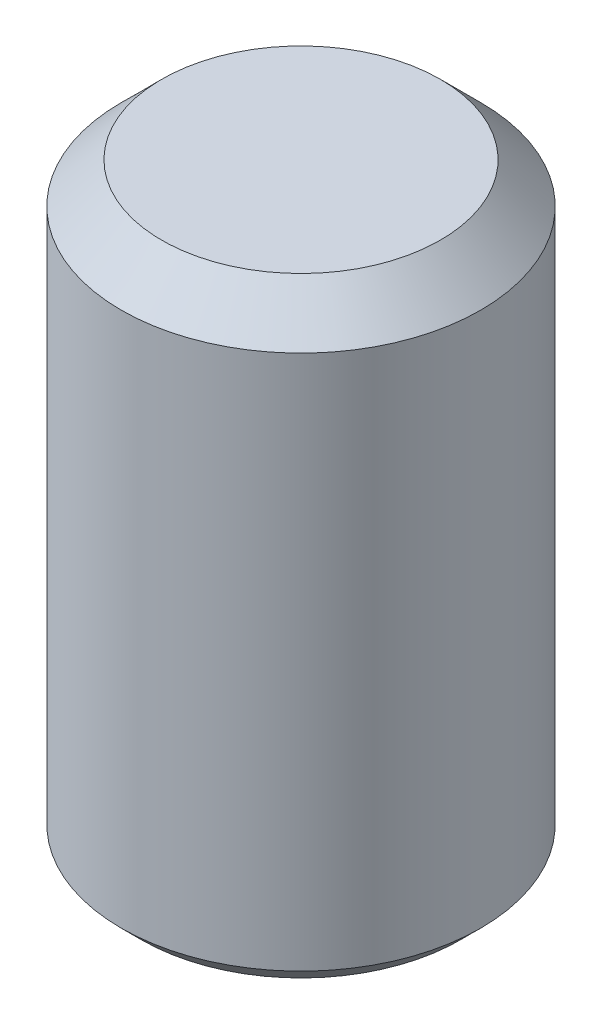
ISO-10303-21;
HEADER;
FILE_DESCRIPTION(('STEP AP214'),'2;1');
FILE_NAME('part.step','',(''),(''),'','','');
FILE_SCHEMA(('AUTOMOTIVE_DESIGN { 1 0 10303 214 1 1 1 1 }'));
ENDSEC;
DATA;
#1=APPLICATION_CONTEXT('core data for automotive mechanical design processes');
#2=APPLICATION_PROTOCOL_DEFINITION('international standard','automotive_design',2000,#1);
#3=PRODUCT_CONTEXT('',#1,'mechanical');
#4=PRODUCT('Part','Part','',(#3));
#5=PRODUCT_RELATED_PRODUCT_CATEGORY('part','',(#4));
#6=PRODUCT_DEFINITION_FORMATION('','',#4);
#7=PRODUCT_DEFINITION_CONTEXT('part definition',#1,'design');
#8=PRODUCT_DEFINITION('design','',#6,#7);
#9=PRODUCT_DEFINITION_SHAPE('','',#8);
#10=(LENGTH_UNIT() NAMED_UNIT(*) SI_UNIT(.MILLI.,.METRE.));
#11=(NAMED_UNIT(*) PLANE_ANGLE_UNIT() SI_UNIT($,.RADIAN.));
#12=(NAMED_UNIT(*) SI_UNIT($,.STERADIAN.) SOLID_ANGLE_UNIT());
#13=UNCERTAINTY_MEASURE_WITH_UNIT(LENGTH_MEASURE(1.E-05),#10,'distance_accuracy_value','');
#14=(GEOMETRIC_REPRESENTATION_CONTEXT(3) GLOBAL_UNCERTAINTY_ASSIGNED_CONTEXT((#13)) GLOBAL_UNIT_ASSIGNED_CONTEXT((#10,
#11,#12)) REPRESENTATION_CONTEXT('',''));
#15=CARTESIAN_POINT('',(0.,0.,0.));
#16=DIRECTION('',(0.,0.,1.));
#17=DIRECTION('',(1.,0.,0.));
#18=AXIS2_PLACEMENT_3D('',#15,#16,#17);
#19=CARTESIAN_POINT('',(0.,0.375,0.));
#20=DIRECTION('',(0.,-1.,0.));
#21=DIRECTION('',(0.,0.,-1.));
#22=AXIS2_PLACEMENT_3D('',#19,#20,#21);
#23=PLANE('',#22);
#24=DIRECTION('',(0.5,0.,0.866025403784439));
#25=VECTOR('',#24,1.);
#26=CARTESIAN_POINT('',(-0.235,0.375,0.407031939778686));
#27=LINE('',#26,#25);
#28=CARTESIAN_POINT('',(-0.235,0.375,0.407031939778686));
#29=VERTEX_POINT('',#28);
#30=CARTESIAN_POINT('',(-0.47,0.375,0.));
#31=VERTEX_POINT('',#30);
#32=EDGE_CURVE('E128',#29,#31,#27,.F.);
#33=ORIENTED_EDGE('',*,*,#32,.T.);
#34=DIRECTION('',(-0.5,0.,0.866025403784439));
#35=VECTOR('',#34,1.);
#36=CARTESIAN_POINT('',(-0.47,0.375,0.));
#37=LINE('',#36,#35);
#38=CARTESIAN_POINT('',(-0.235,0.375,-0.407031939778686));
#39=VERTEX_POINT('',#38);
#40=EDGE_CURVE('E123',#31,#39,#37,.F.);
#41=ORIENTED_EDGE('',*,*,#40,.T.);
#42=DIRECTION('',(-1.,0.,0.));
#43=VECTOR('',#42,1.);
#44=CARTESIAN_POINT('',(-0.235,0.375,-0.407031939778686));
#45=LINE('',#44,#43);
#46=CARTESIAN_POINT('',(0.235,0.375,-0.407031939778686));
#47=VERTEX_POINT('',#46);
#48=EDGE_CURVE('E73',#39,#47,#45,.F.);
#49=ORIENTED_EDGE('',*,*,#48,.T.);
#50=DIRECTION('',(-0.5,0.,-0.866025403784439));
#51=VECTOR('',#50,1.);
#52=CARTESIAN_POINT('',(0.235,0.375,-0.407031939778686));
#53=LINE('',#52,#51);
#54=CARTESIAN_POINT('',(0.47,0.375,0.));
#55=VERTEX_POINT('',#54);
#56=EDGE_CURVE('E70',#47,#55,#53,.F.);
#57=ORIENTED_EDGE('',*,*,#56,.T.);
#58=DIRECTION('',(0.5,0.,-0.866025403784439));
#59=VECTOR('',#58,1.);
#60=CARTESIAN_POINT('',(0.47,0.375,0.));
#61=LINE('',#60,#59);
#62=CARTESIAN_POINT('',(0.235,0.375,0.407031939778686));
#63=VERTEX_POINT('',#62);
#64=EDGE_CURVE('E67',#55,#63,#61,.F.);
#65=ORIENTED_EDGE('',*,*,#64,.T.);
#66=DIRECTION('',(1.,0.,0.));
#67=VECTOR('',#66,1.);
#68=CARTESIAN_POINT('',(0.235,0.375,0.407031939778686));
#69=LINE('',#68,#67);
#70=EDGE_CURVE('E90',#63,#29,#69,.F.);
#71=ORIENTED_EDGE('',*,*,#70,.T.);
#72=EDGE_LOOP('',(#33,#41,#49,#57,#65,#71));
#73=FACE_BOUND('',#72,.T.);
#74=ADVANCED_FACE('F16',(#73),#23,.T.);
#75=CARTESIAN_POINT('',(0.235,0.,-0.407031939778686));
#76=DIRECTION('',(0.866025403784439,0.,-0.5));
#77=DIRECTION('',(-0.5,0.,-0.866025403784439));
#78=AXIS2_PLACEMENT_3D('',#75,#76,#77);
#79=PLANE('',#78);
#80=DIRECTION('',(0.,1.,0.));
#81=VECTOR('',#80,1.);
#82=CARTESIAN_POINT('',(0.47,0.,0.));
#83=LINE('',#82,#81);
#84=CARTESIAN_POINT('',(0.47,0.,0.));
#85=VERTEX_POINT('',#84);
#86=EDGE_CURVE('E76',#85,#55,#83,.T.);
#87=ORIENTED_EDGE('',*,*,#86,.T.);
#88=ORIENTED_EDGE('',*,*,#56,.F.);
#89=DIRECTION('',(0.,1.,0.));
#90=VECTOR('',#89,1.);
#91=CARTESIAN_POINT('',(0.235,0.,-0.407031939778686));
#92=LINE('',#91,#90);
#93=CARTESIAN_POINT('',(0.235,0.,-0.407031939778686));
#94=VERTEX_POINT('',#93);
#95=EDGE_CURVE('E118',#47,#94,#92,.F.);
#96=ORIENTED_EDGE('',*,*,#95,.T.);
#97=DIRECTION('',(0.5,0.,0.866025403784439));
#98=VECTOR('',#97,1.);
#99=CARTESIAN_POINT('',(0.235,0.,-0.407031939778686));
#100=LINE('',#99,#98);
#101=EDGE_CURVE('E81',#94,#85,#100,.T.);
#102=ORIENTED_EDGE('',*,*,#101,.T.);
#103=EDGE_LOOP('',(#87,#88,#96,#102));
#104=FACE_BOUND('',#103,.T.);
#105=ADVANCED_FACE('F79',(#104),#79,.F.);
#106=CARTESIAN_POINT('',(0.47,0.,0.));
#107=DIRECTION('',(0.866025403784439,0.,0.5));
#108=DIRECTION('',(0.5,0.,-0.866025403784439));
#109=AXIS2_PLACEMENT_3D('',#106,#107,#108);
#110=PLANE('',#109);
#111=DIRECTION('',(0.,1.,0.));
#112=VECTOR('',#111,1.);
#113=CARTESIAN_POINT('',(0.235,0.,0.407031939778686));
#114=LINE('',#113,#112);
#115=CARTESIAN_POINT('',(0.235,0.,0.407031939778686));
#116=VERTEX_POINT('',#115);
#117=EDGE_CURVE('E87',#116,#63,#114,.T.);
#118=ORIENTED_EDGE('',*,*,#117,.T.);
#119=ORIENTED_EDGE('',*,*,#64,.F.);
#120=ORIENTED_EDGE('',*,*,#86,.F.);
#121=DIRECTION('',(-0.5,0.,0.866025403784439));
#122=VECTOR('',#121,1.);
#123=CARTESIAN_POINT('',(0.47,0.,0.));
#124=LINE('',#123,#122);
#125=EDGE_CURVE('E115',#85,#116,#124,.T.);
#126=ORIENTED_EDGE('',*,*,#125,.T.);
#127=EDGE_LOOP('',(#118,#119,#120,#126));
#128=FACE_BOUND('',#127,.T.);
#129=ADVANCED_FACE('F85',(#128),#110,.F.);
#130=CARTESIAN_POINT('',(0.235,0.,0.407031939778686));
#131=DIRECTION('',(0.,0.,1.));
#132=DIRECTION('',(1.,0.,0.));
#133=AXIS2_PLACEMENT_3D('',#130,#131,#132);
#134=PLANE('',#133);
#135=DIRECTION('',(0.,1.,0.));
#136=VECTOR('',#135,1.);
#137=CARTESIAN_POINT('',(-0.235,0.,0.407031939778686));
#138=LINE('',#137,#136);
#139=CARTESIAN_POINT('',(-0.235,0.,0.407031939778686));
#140=VERTEX_POINT('',#139);
#141=EDGE_CURVE('E130',#140,#29,#138,.T.);
#142=ORIENTED_EDGE('',*,*,#141,.T.);
#143=ORIENTED_EDGE('',*,*,#70,.F.);
#144=ORIENTED_EDGE('',*,*,#117,.F.);
#145=DIRECTION('',(1.,0.,0.));
#146=VECTOR('',#145,1.);
#147=CARTESIAN_POINT('',(0.,0.,0.407031939778686));
#148=LINE('',#147,#146);
#149=EDGE_CURVE('E113',#116,#140,#148,.F.);
#150=ORIENTED_EDGE('',*,*,#149,.T.);
#151=EDGE_LOOP('',(#142,#143,#144,#150));
#152=FACE_BOUND('',#151,.T.);
#153=ADVANCED_FACE('F135',(#152),#134,.F.);
#154=CARTESIAN_POINT('',(-0.235,0.,0.407031939778686));
#155=DIRECTION('',(-0.866025403784439,0.,0.5));
#156=DIRECTION('',(0.5,0.,0.866025403784439));
#157=AXIS2_PLACEMENT_3D('',#154,#155,#156);
#158=PLANE('',#157);
#159=DIRECTION('',(0.,1.,0.));
#160=VECTOR('',#159,1.);
#161=CARTESIAN_POINT('',(-0.47,0.,0.));
#162=LINE('',#161,#160);
#163=CARTESIAN_POINT('',(-0.47,0.,0.));
#164=VERTEX_POINT('',#163);
#165=EDGE_CURVE('E125',#164,#31,#162,.T.);
#166=ORIENTED_EDGE('',*,*,#165,.T.);
#167=ORIENTED_EDGE('',*,*,#32,.F.);
#168=ORIENTED_EDGE('',*,*,#141,.F.);
#169=DIRECTION('',(-0.5,0.,-0.866025403784438));
#170=VECTOR('',#169,1.);
#171=CARTESIAN_POINT('',(-0.235,0.,0.407031939778686));
#172=LINE('',#171,#170);
#173=EDGE_CURVE('E107',#140,#164,#172,.T.);
#174=ORIENTED_EDGE('',*,*,#173,.T.);
#175=EDGE_LOOP('',(#166,#167,#168,#174));
#176=FACE_BOUND('',#175,.T.);
#177=ADVANCED_FACE('F139',(#176),#158,.F.);
#178=CARTESIAN_POINT('',(-0.47,0.,0.));
#179=DIRECTION('',(-0.866025403784439,0.,-0.5));
#180=DIRECTION('',(-0.5,0.,0.866025403784439));
#181=AXIS2_PLACEMENT_3D('',#178,#179,#180);
#182=PLANE('',#181);
#183=DIRECTION('',(0.,1.,0.));
#184=VECTOR('',#183,1.);
#185=CARTESIAN_POINT('',(-0.235,0.,-0.407031939778686));
#186=LINE('',#185,#184);
#187=CARTESIAN_POINT('',(-0.235,0.,-0.407031939778686));
#188=VERTEX_POINT('',#187);
#189=EDGE_CURVE('E121',#188,#39,#186,.T.);
#190=ORIENTED_EDGE('',*,*,#189,.T.);
#191=ORIENTED_EDGE('',*,*,#40,.F.);
#192=ORIENTED_EDGE('',*,*,#165,.F.);
#193=DIRECTION('',(0.5,0.,-0.866025403784439));
#194=VECTOR('',#193,1.);
#195=CARTESIAN_POINT('',(-0.47,0.,0.));
#196=LINE('',#195,#194);
#197=EDGE_CURVE('E34',#164,#188,#196,.T.);
#198=ORIENTED_EDGE('',*,*,#197,.T.);
#199=EDGE_LOOP('',(#190,#191,#192,#198));
#200=FACE_BOUND('',#199,.T.);
#201=ADVANCED_FACE('F141',(#200),#182,.F.);
#202=CARTESIAN_POINT('',(-0.235,0.,-0.407031939778686));
#203=DIRECTION('',(0.,0.,-1.));
#204=DIRECTION('',(-1.,0.,0.));
#205=AXIS2_PLACEMENT_3D('',#202,#203,#204);
#206=PLANE('',#205);
#207=ORIENTED_EDGE('',*,*,#95,.F.);
#208=ORIENTED_EDGE('',*,*,#48,.F.);
#209=ORIENTED_EDGE('',*,*,#189,.F.);
#210=DIRECTION('',(1.,0.,0.));
#211=VECTOR('',#210,1.);
#212=CARTESIAN_POINT('',(0.,0.,-0.407031939778686));
#213=LINE('',#212,#211);
#214=EDGE_CURVE('E100',#188,#94,#213,.T.);
#215=ORIENTED_EDGE('',*,*,#214,.T.);
#216=EDGE_LOOP('',(#207,#208,#209,#215));
#217=FACE_BOUND('',#216,.T.);
#218=ADVANCED_FACE('F142',(#217),#206,.F.);
#219=CARTESIAN_POINT('',(0.,0.,0.));
#220=DIRECTION('',(0.,1.,0.));
#221=DIRECTION('',(0.,0.,1.));
#222=AXIS2_PLACEMENT_3D('',#219,#220,#221);
#223=PLANE('',#222);
#224=ORIENTED_EDGE('',*,*,#197,.F.);
#225=ORIENTED_EDGE('',*,*,#173,.F.);
#226=ORIENTED_EDGE('',*,*,#149,.F.);
#227=ORIENTED_EDGE('',*,*,#125,.F.);
#228=ORIENTED_EDGE('',*,*,#101,.F.);
#229=ORIENTED_EDGE('',*,*,#214,.F.);
#230=EDGE_LOOP('',(#224,#225,#226,#227,#228,#229));
#231=FACE_BOUND('',#230,.T.);
#232=CARTESIAN_POINT('',(0.,5.68434324133352E-11,0.));
#233=DIRECTION('',(0.,1.,0.));
#234=DIRECTION('',(0.,0.,1.));
#235=AXIS2_PLACEMENT_3D('',#232,#233,#234);
#236=CIRCLE('',#235,0.790000000051804);
#237=CARTESIAN_POINT('',(0.,5.68434324133352E-11,0.790000000051803));
#238=VERTEX_POINT('',#237);
#239=EDGE_CURVE('E19',#238,#238,#236,.T.);
#240=ORIENTED_EDGE('',*,*,#239,.F.);
#241=EDGE_LOOP('',(#240));
#242=FACE_BOUND('',#241,.T.);
#243=ADVANCED_FACE('F144',(#231,#242),#223,.F.);
#244=CARTESIAN_POINT('',(0.,2.95,0.));
#245=DIRECTION('',(0.,1.,0.));
#246=DIRECTION('',(0.,0.,1.));
#247=AXIS2_PLACEMENT_3D('',#244,#245,#246);
#248=PLANE('',#247);
#249=CARTESIAN_POINT('',(0.,2.94999999999845,0.));
#250=DIRECTION('',(0.,-1.,0.));
#251=DIRECTION('',(0.,0.,-1.));
#252=AXIS2_PLACEMENT_3D('',#249,#250,#251);
#253=CIRCLE('',#252,0.690000000020063);
#254=CARTESIAN_POINT('',(0.,2.94999999999845,-0.690000000020063));
#255=VERTEX_POINT('',#254);
#256=EDGE_CURVE('E93',#255,#255,#253,.T.);
#257=ORIENTED_EDGE('',*,*,#256,.F.);
#258=EDGE_LOOP('',(#257));
#259=FACE_BOUND('',#258,.T.);
#260=ADVANCED_FACE('F152',(#259),#248,.T.);
#261=CARTESIAN_POINT('',(0.,0.0999999998612111,0.));
#262=DIRECTION('',(0.,1.,0.));
#263=DIRECTION('',(0.,0.,1.));
#264=AXIS2_PLACEMENT_3D('',#261,#262,#263);
#265=CONICAL_SURFACE('',#264,0.889999999913015,0.785398163681665);
#266=CARTESIAN_POINT('',(0.,0.1,0.));
#267=DIRECTION('',(0.,1.,0.));
#268=DIRECTION('',(0.,0.,1.));
#269=AXIS2_PLACEMENT_3D('',#266,#267,#268);
#270=CIRCLE('',#269,0.89);
#271=CARTESIAN_POINT('',(0.,0.1,0.89));
#272=VERTEX_POINT('',#271);
#273=EDGE_CURVE('E25',#272,#272,#270,.T.);
#274=ORIENTED_EDGE('',*,*,#273,.F.);
#275=EDGE_LOOP('',(#274));
#276=FACE_BOUND('',#275,.T.);
#277=ORIENTED_EDGE('',*,*,#239,.T.);
#278=EDGE_LOOP('',(#277));
#279=FACE_BOUND('',#278,.T.);
#280=ADVANCED_FACE('F165',(#276,#279),#265,.T.);
#281=CARTESIAN_POINT('',(0.,2.75000000004866,0.));
#282=DIRECTION('',(0.,-1.,0.));
#283=DIRECTION('',(0.,0.,-1.));
#284=AXIS2_PLACEMENT_3D('',#281,#282,#283);
#285=CONICAL_SURFACE('',#284,0.889999999913016,0.78539816325534);
#286=CARTESIAN_POINT('',(0.,2.75,0.));
#287=DIRECTION('',(0.,1.,0.));
#288=DIRECTION('',(0.,0.,1.));
#289=AXIS2_PLACEMENT_3D('',#286,#287,#288);
#290=CIRCLE('',#289,0.89);
#291=CARTESIAN_POINT('',(0.,2.75,0.89));
#292=VERTEX_POINT('',#291);
#293=EDGE_CURVE('E11',#292,#292,#290,.F.);
#294=ORIENTED_EDGE('',*,*,#293,.F.);
#295=EDGE_LOOP('',(#294));
#296=FACE_BOUND('',#295,.T.);
#297=ORIENTED_EDGE('',*,*,#256,.T.);
#298=EDGE_LOOP('',(#297));
#299=FACE_BOUND('',#298,.T.);
#300=ADVANCED_FACE('F158',(#296,#299),#285,.T.);
#301=CARTESIAN_POINT('',(0.,0.,0.));
#302=DIRECTION('',(0.,1.,0.));
#303=DIRECTION('',(0.,0.,1.));
#304=AXIS2_PLACEMENT_3D('',#301,#302,#303);
#305=CYLINDRICAL_SURFACE('',#304,0.89);
#306=ORIENTED_EDGE('',*,*,#293,.T.);
#307=EDGE_LOOP('',(#306));
#308=FACE_BOUND('',#307,.T.);
#309=ORIENTED_EDGE('',*,*,#273,.T.);
#310=EDGE_LOOP('',(#309));
#311=FACE_BOUND('',#310,.T.);
#312=ADVANCED_FACE('F156',(#308,#311),#305,.T.);
#313=CLOSED_SHELL('',(#74,#105,#129,#153,#177,#201,#218,#243,#260,#280,#300,#312));
#314=MANIFOLD_SOLID_BREP('B1',#313);
#315=ADVANCED_BREP_SHAPE_REPRESENTATION('',(#18,#314),#14);
#316=SHAPE_DEFINITION_REPRESENTATION(#9,#315);
ENDSEC;
END-ISO-10303-21;
